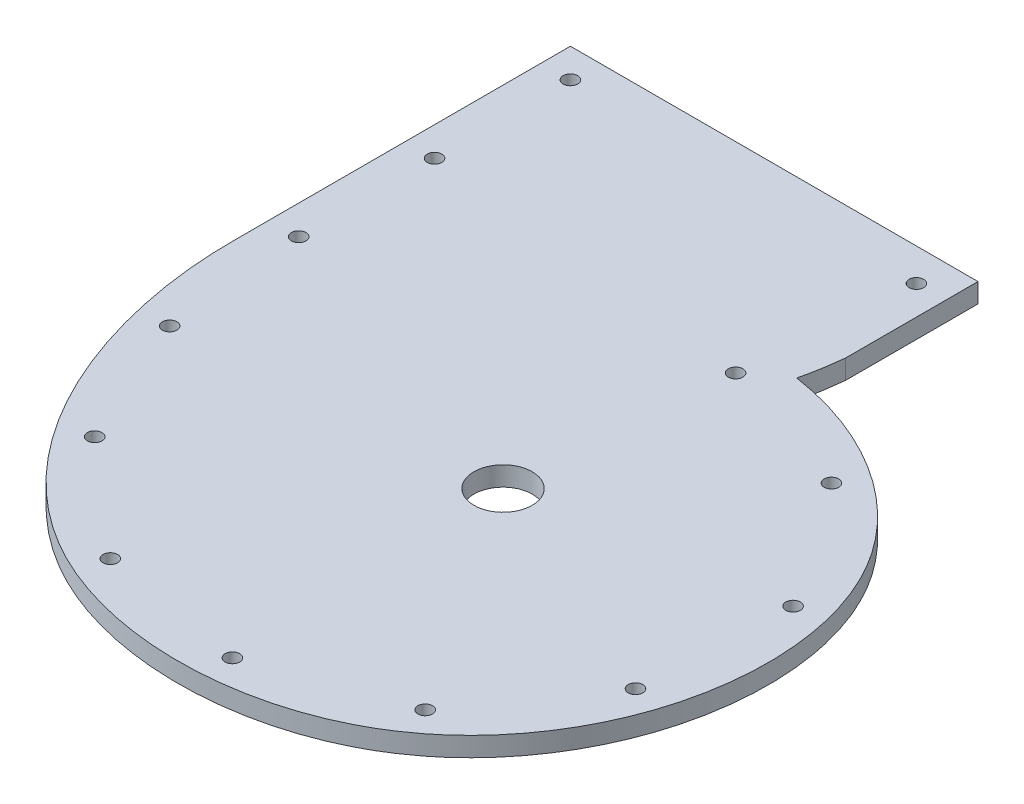
ISO-10303-21;
HEADER;
FILE_DESCRIPTION(('STEP AP214'),'2;1');
FILE_NAME('part.step','',(''),(''),'','','');
FILE_SCHEMA(('AUTOMOTIVE_DESIGN { 1 0 10303 214 1 1 1 1 }'));
ENDSEC;
DATA;
#1=APPLICATION_CONTEXT('core data for automotive mechanical design processes');
#2=APPLICATION_PROTOCOL_DEFINITION('international standard','automotive_design',2000,#1);
#3=PRODUCT_CONTEXT('',#1,'mechanical');
#4=PRODUCT('Part','Part','',(#3));
#5=PRODUCT_RELATED_PRODUCT_CATEGORY('part','',(#4));
#6=PRODUCT_DEFINITION_FORMATION('','',#4);
#7=PRODUCT_DEFINITION_CONTEXT('part definition',#1,'design');
#8=PRODUCT_DEFINITION('design','',#6,#7);
#9=PRODUCT_DEFINITION_SHAPE('','',#8);
#10=(LENGTH_UNIT() NAMED_UNIT(*) SI_UNIT(.MILLI.,.METRE.));
#11=(NAMED_UNIT(*) PLANE_ANGLE_UNIT() SI_UNIT($,.RADIAN.));
#12=(NAMED_UNIT(*) SI_UNIT($,.STERADIAN.) SOLID_ANGLE_UNIT());
#13=UNCERTAINTY_MEASURE_WITH_UNIT(LENGTH_MEASURE(1.E-05),#10,'distance_accuracy_value','');
#14=(GEOMETRIC_REPRESENTATION_CONTEXT(3) GLOBAL_UNCERTAINTY_ASSIGNED_CONTEXT((#13)) GLOBAL_UNIT_ASSIGNED_CONTEXT((#10,
#11,#12)) REPRESENTATION_CONTEXT('',''));
#15=CARTESIAN_POINT('',(0.,0.,0.));
#16=DIRECTION('',(0.,0.,1.));
#17=DIRECTION('',(1.,0.,0.));
#18=AXIS2_PLACEMENT_3D('',#15,#16,#17);
#19=CARTESIAN_POINT('',(19.05,6.35,-93.0525131214236));
#20=CARTESIAN_POINT('',(19.0235717626698,6.35,-92.8091366928728));
#21=CARTESIAN_POINT('',(18.9836928683942,6.35,-92.4430892244958));
#22=CARTESIAN_POINT('',(18.9314671624808,6.35,-91.9589572355302));
#23=CARTESIAN_POINT('',(18.8623607981838,6.35,-91.3379157509415));
#24=CARTESIAN_POINT('',(18.7762928711156,6.35,-90.6107808851603));
#25=CARTESIAN_POINT('',(18.6259027213404,6.35,-89.4251283904721));
#26=CARTESIAN_POINT('',(18.4201228683112,6.35,-87.9598584476399));
#27=CARTESIAN_POINT('',(18.0499905632596,6.35,-85.6275758075247));
#28=CARTESIAN_POINT('',(17.5101435713735,6.35,-82.7435971471794));
#29=CARTESIAN_POINT('',(16.996105498509,6.35,-80.4784646355363));
#30=CARTESIAN_POINT('',(16.7159863913014,6.35,-79.3485680085002));
#31=B_SPLINE_CURVE_WITH_KNOTS('',3,(#19,#20,#21,#22,#23,#24,#25,#26,#27,#28,#29,#30),
.UNSPECIFIED.,.F.,.F.,(4,1,1,1,1,1,1,1,1,4),(-0.0228949743215874,-0.00659054938911569,
0.00156166307712017,0.00971387554335602,0.0260183004758277,0.0423227254082994,
0.0749315752732429,0.107540425138186,0.172758124868073,0.23797582459796),.UNSPECIFIED.);
#32=DIRECTION('',(0.,-1.,0.));
#33=VECTOR('',#32,1.);
#34=SURFACE_OF_LINEAR_EXTRUSION('',#31,#33);
#35=CARTESIAN_POINT('',(19.05,0.,-93.0525131214236));
#36=CARTESIAN_POINT('',(19.0235717626698,0.,-92.8091366928728));
#37=CARTESIAN_POINT('',(18.9836928683942,0.,-92.4430892244958));
#38=CARTESIAN_POINT('',(18.9314671624808,0.,-91.9589572355302));
#39=CARTESIAN_POINT('',(18.8623607981838,0.,-91.3379157509415));
#40=CARTESIAN_POINT('',(18.7762928711156,0.,-90.6107808851603));
#41=CARTESIAN_POINT('',(18.6259027213404,0.,-89.4251283904721));
#42=CARTESIAN_POINT('',(18.4201228683112,0.,-87.9598584476399));
#43=CARTESIAN_POINT('',(18.0499905632596,0.,-85.6275758075247));
#44=CARTESIAN_POINT('',(17.5101435713735,0.,-82.7435971471794));
#45=CARTESIAN_POINT('',(16.996105498509,0.,-80.4784646355363));
#46=CARTESIAN_POINT('',(16.7159863913014,0.,-79.3485680085002));
#47=B_SPLINE_CURVE_WITH_KNOTS('',3,(#35,#36,#37,#38,#39,#40,#41,#42,#43,#44,#45,#46),
.UNSPECIFIED.,.F.,.F.,(4,1,1,1,1,1,1,1,1,4),(-0.0228949743215874,-0.00659054938911569,
0.00156166307712017,0.00971387554335602,0.0260183004758277,0.0423227254082994,
0.0749315752732429,0.107540425138186,0.172758124868073,0.23797582459796),.UNSPECIFIED.);
#48=CARTESIAN_POINT('',(19.05,0.,-93.0525131214236));
#49=VERTEX_POINT('',#48);
#50=CARTESIAN_POINT('',(16.7159863913014,0.,-79.3485680085002));
#51=VERTEX_POINT('',#50);
#52=EDGE_CURVE('E145',#49,#51,#47,.T.);
#53=ORIENTED_EDGE('',*,*,#52,.F.);
#54=DIRECTION('',(0.,-1.,0.));
#55=VECTOR('',#54,1.);
#56=CARTESIAN_POINT('',(19.05,6.35,-93.0525131214236));
#57=LINE('',#56,#55);
#58=CARTESIAN_POINT('',(19.05,6.35,-93.0525131214236));
#59=VERTEX_POINT('',#58);
#60=EDGE_CURVE('E13',#59,#49,#57,.T.);
#61=ORIENTED_EDGE('',*,*,#60,.F.);
#62=CARTESIAN_POINT('',(16.7159863913014,6.35,-79.3485680085002));
#63=VERTEX_POINT('',#62);
#64=EDGE_CURVE('E182',#59,#63,#31,.T.);
#65=ORIENTED_EDGE('',*,*,#64,.T.);
#66=DIRECTION('',(0.,-1.,0.));
#67=VECTOR('',#66,1.);
#68=CARTESIAN_POINT('',(16.7159863913014,6.35,-79.3485680085002));
#69=LINE('',#68,#67);
#70=EDGE_CURVE('E84',#63,#51,#69,.T.);
#71=ORIENTED_EDGE('',*,*,#70,.T.);
#72=EDGE_LOOP('',(#53,#61,#65,#71));
#73=FACE_BOUND('',#72,.T.);
#74=ADVANCED_FACE('F67',(#73),#34,.T.);
#75=CARTESIAN_POINT('',(19.05,6.35,0.));
#76=DIRECTION('',(1.,0.,0.));
#77=DIRECTION('',(0.,0.,-1.));
#78=AXIS2_PLACEMENT_3D('',#75,#76,#77);
#79=PLANE('',#78);
#80=DIRECTION('',(0.,0.,1.));
#81=VECTOR('',#80,1.);
#82=CARTESIAN_POINT('',(19.05,0.,0.));
#83=LINE('',#82,#81);
#84=CARTESIAN_POINT('',(19.05,0.,-136.334024978483));
#85=VERTEX_POINT('',#84);
#86=EDGE_CURVE('E170',#85,#49,#83,.T.);
#87=ORIENTED_EDGE('',*,*,#86,.F.);
#88=DIRECTION('',(0.,-1.,0.));
#89=VECTOR('',#88,1.);
#90=CARTESIAN_POINT('',(19.05,6.35,-136.334024978483));
#91=LINE('',#90,#89);
#92=CARTESIAN_POINT('',(19.05,6.35,-136.334024978483));
#93=VERTEX_POINT('',#92);
#94=EDGE_CURVE('E76',#93,#85,#91,.T.);
#95=ORIENTED_EDGE('',*,*,#94,.F.);
#96=DIRECTION('',(0.,0.,1.));
#97=VECTOR('',#96,1.);
#98=CARTESIAN_POINT('',(19.05,6.35,0.));
#99=LINE('',#98,#97);
#100=EDGE_CURVE('E125',#93,#59,#99,.T.);
#101=ORIENTED_EDGE('',*,*,#100,.T.);
#102=ORIENTED_EDGE('',*,*,#60,.T.);
#103=EDGE_LOOP('',(#87,#95,#101,#102));
#104=FACE_BOUND('',#103,.T.);
#105=ADVANCED_FACE('F162',(#104),#79,.T.);
#106=CARTESIAN_POINT('',(0.,6.35,-136.334024978483));
#107=DIRECTION('',(0.,0.,1.));
#108=DIRECTION('',(1.,0.,0.));
#109=AXIS2_PLACEMENT_3D('',#106,#107,#108);
#110=PLANE('',#109);
#111=DIRECTION('',(-1.,0.,0.));
#112=VECTOR('',#111,1.);
#113=CARTESIAN_POINT('',(0.,0.,-136.334024978483));
#114=LINE('',#113,#112);
#115=CARTESIAN_POINT('',(-114.3,0.,-136.334024978483));
#116=VERTEX_POINT('',#115);
#117=EDGE_CURVE('E132',#85,#116,#114,.T.);
#118=ORIENTED_EDGE('',*,*,#117,.T.);
#119=DIRECTION('',(0.,-1.,0.));
#120=VECTOR('',#119,1.);
#121=CARTESIAN_POINT('',(-114.3,6.35,-136.334024978483));
#122=LINE('',#121,#120);
#123=CARTESIAN_POINT('',(-114.3,6.35,-136.334024978483));
#124=VERTEX_POINT('',#123);
#125=EDGE_CURVE('E130',#124,#116,#122,.T.);
#126=ORIENTED_EDGE('',*,*,#125,.F.);
#127=DIRECTION('',(-1.,0.,0.));
#128=VECTOR('',#127,1.);
#129=CARTESIAN_POINT('',(0.,6.35,-136.334024978483));
#130=LINE('',#129,#128);
#131=EDGE_CURVE('E117',#93,#124,#130,.T.);
#132=ORIENTED_EDGE('',*,*,#131,.F.);
#133=ORIENTED_EDGE('',*,*,#94,.T.);
#134=EDGE_LOOP('',(#118,#126,#132,#133));
#135=FACE_BOUND('',#134,.T.);
#136=ADVANCED_FACE('F131',(#135),#110,.F.);
#137=CARTESIAN_POINT('',(-114.3,6.35,0.));
#138=DIRECTION('',(1.,0.,0.));
#139=DIRECTION('',(0.,0.,-1.));
#140=AXIS2_PLACEMENT_3D('',#137,#138,#139);
#141=PLANE('',#140);
#142=DIRECTION('',(0.,0.,1.));
#143=VECTOR('',#142,1.);
#144=CARTESIAN_POINT('',(-114.3,0.,0.));
#145=LINE('',#144,#143);
#146=CARTESIAN_POINT('',(-114.3,0.,-26.0721112281661));
#147=VERTEX_POINT('',#146);
#148=EDGE_CURVE('E172',#116,#147,#145,.T.);
#149=ORIENTED_EDGE('',*,*,#148,.T.);
#150=DIRECTION('',(0.,-1.,0.));
#151=VECTOR('',#150,1.);
#152=CARTESIAN_POINT('',(-114.3,6.35,-26.0721112281661));
#153=LINE('',#152,#151);
#154=CARTESIAN_POINT('',(-114.3,6.35,-26.0721112281661));
#155=VERTEX_POINT('',#154);
#156=EDGE_CURVE('E101',#155,#147,#153,.T.);
#157=ORIENTED_EDGE('',*,*,#156,.F.);
#158=DIRECTION('',(0.,0.,1.));
#159=VECTOR('',#158,1.);
#160=CARTESIAN_POINT('',(-114.3,6.35,0.));
#161=LINE('',#160,#159);
#162=EDGE_CURVE('E123',#124,#155,#161,.T.);
#163=ORIENTED_EDGE('',*,*,#162,.F.);
#164=ORIENTED_EDGE('',*,*,#125,.T.);
#165=EDGE_LOOP('',(#149,#157,#163,#164));
#166=FACE_BOUND('',#165,.T.);
#167=ADVANCED_FACE('F136',(#166),#141,.F.);
#168=CARTESIAN_POINT('',(16.7159863913014,6.35,-79.3485680085002));
#169=CARTESIAN_POINT('',(21.6330978705224,6.35,-78.6271989598531));
#170=CARTESIAN_POINT('',(31.3718572612699,6.35,-76.3897218941116));
#171=CARTESIAN_POINT('',(45.2492004972199,6.35,-70.8452769607163));
#172=CARTESIAN_POINT('',(58.1427020202069,6.35,-63.2023547019803));
#173=CARTESIAN_POINT('',(69.6942684990019,6.35,-53.48659400402));
#174=CARTESIAN_POINT('',(77.8316458808527,6.35,-43.6787438983676));
#175=CARTESIAN_POINT('',(83.1663553001762,6.35,-34.7783260421134));
#176=CARTESIAN_POINT('',(87.5006566564551,6.35,-25.5003387116442));
#177=CARTESIAN_POINT('',(91.1570644324476,6.35,-13.4000448880706));
#178=CARTESIAN_POINT('',(92.9989240789807,6.35,1.46366621805663));
#179=CARTESIAN_POINT('',(92.5331586276137,6.35,16.3321608555447));
#180=CARTESIAN_POINT('',(89.9113480457351,6.35,30.9228680078494));
#181=CARTESIAN_POINT('',(85.2246697026399,6.35,44.926534482478));
#182=CARTESIAN_POINT('',(78.5424766002794,6.35,58.0873215625547));
#183=CARTESIAN_POINT('',(69.8929665542091,6.35,70.1280882226925));
#184=CARTESIAN_POINT('',(59.3342250850972,6.35,80.7225189459671));
#185=CARTESIAN_POINT('',(46.8082946762808,6.35,89.4843789599546));
#186=CARTESIAN_POINT('',(33.1657508535722,6.35,95.8312045365591));
#187=CARTESIAN_POINT('',(18.8220757998214,6.35,100.000437450495));
#188=CARTESIAN_POINT('',(4.08382286145167,6.35,102.10160242432));
#189=CARTESIAN_POINT('',(-10.7774412230892,6.35,102.21979996101));
#190=CARTESIAN_POINT('',(-25.5048511364746,6.35,100.381408636179));
#191=CARTESIAN_POINT('',(-37.4527415030442,6.35,97.1973224935949));
#192=CARTESIAN_POINT('',(-46.6656390896169,6.35,93.6226539944936));
#193=CARTESIAN_POINT('',(-53.3782339827533,6.35,90.4042691275464));
#194=CARTESIAN_POINT('',(-59.7780191628772,6.35,86.6678318366041));
#195=CARTESIAN_POINT('',(-67.7729642470086,6.35,81.1134949695859));
#196=CARTESIAN_POINT('',(-76.7948383172267,6.35,73.1919966973664));
#197=CARTESIAN_POINT('',(-86.0825071986507,6.35,62.4802459776523));
#198=CARTESIAN_POINT('',(-96.5268651878926,6.35,46.9789350867326));
#199=CARTESIAN_POINT('',(-104.247410810002,6.35,30.1516401250863));
#200=CARTESIAN_POINT('',(-109.533831829891,6.35,12.8006946264713));
#201=CARTESIAN_POINT('',(-112.324631517154,6.35,-0.30605110665803));
#202=CARTESIAN_POINT('',(-113.69827349308,6.35,-11.1587802232802));
#203=CARTESIAN_POINT('',(-114.231429958165,6.35,-19.7408930873515));
#204=CARTESIAN_POINT('',(-114.308990647516,6.35,-23.9549561001606));
#205=CARTESIAN_POINT('',(-114.3,6.35,-26.0721112281661));
#206=B_SPLINE_CURVE_WITH_KNOTS('',3,(#168,#169,#170,#171,#172,#173,#174,#175,#176,#177,#178,
#179,#180,#181,#182,#183,#184,#185,#186,#187,#188,#189,#190,#191,#192,#193,#194,#195,#196,#197,
#198,#199,#200,#201,#202,#203,#204,#205),.UNSPECIFIED.,.F.,.F.,(4,1,1,1,1,1,1,1,1,1,1,1,1,1,1,1,
1,1,1,1,1,1,1,1,1,1,1,1,1,1,1,1,1,1,1,4),(0.0744180317666386,0.103339232907731,
0.132260434048823,0.161181635189916,0.190102836331008,0.2190240374721,0.233484638042646,
0.247945238613193,0.276866439754285,0.305787640895377,0.33470884203647,0.363630043177562,
0.392551244318654,0.421472445459747,0.450393646600839,0.479314847741931,0.508236048883024,
0.537157250024116,0.566078451165208,0.594999652306301,0.623920853447393,0.652842054588485,
0.681763255729578,0.696223856300124,0.71068445687067,0.725145057441216,0.739605658011762,
0.768526859152855,0.797448060293947,0.826369261435039,0.884211663717224,0.913132864858316,
0.942054065999409,0.970975267140501,0.985435867711047,0.999896468281593),.UNSPECIFIED.);
#207=DIRECTION('',(0.,-1.,0.));
#208=VECTOR('',#207,1.);
#209=SURFACE_OF_LINEAR_EXTRUSION('',#206,#208);
#210=CARTESIAN_POINT('',(16.7159863913014,0.,-79.3485680085002));
#211=CARTESIAN_POINT('',(21.6330978705224,0.,-78.6271989598531));
#212=CARTESIAN_POINT('',(31.3718572612699,0.,-76.3897218941116));
#213=CARTESIAN_POINT('',(45.2492004972199,0.,-70.8452769607163));
#214=CARTESIAN_POINT('',(58.1427020202069,0.,-63.2023547019803));
#215=CARTESIAN_POINT('',(69.6942684990019,0.,-53.48659400402));
#216=CARTESIAN_POINT('',(77.8316458808527,0.,-43.6787438983676));
#217=CARTESIAN_POINT('',(83.1663553001762,0.,-34.7783260421134));
#218=CARTESIAN_POINT('',(87.5006566564551,0.,-25.5003387116442));
#219=CARTESIAN_POINT('',(91.1570644324476,0.,-13.4000448880706));
#220=CARTESIAN_POINT('',(92.9989240789807,0.,1.46366621805663));
#221=CARTESIAN_POINT('',(92.5331586276137,0.,16.3321608555447));
#222=CARTESIAN_POINT('',(89.9113480457351,0.,30.9228680078494));
#223=CARTESIAN_POINT('',(85.2246697026399,0.,44.926534482478));
#224=CARTESIAN_POINT('',(78.5424766002794,0.,58.0873215625547));
#225=CARTESIAN_POINT('',(69.8929665542091,0.,70.1280882226925));
#226=CARTESIAN_POINT('',(59.3342250850972,0.,80.7225189459671));
#227=CARTESIAN_POINT('',(46.8082946762808,0.,89.4843789599546));
#228=CARTESIAN_POINT('',(33.1657508535722,0.,95.8312045365591));
#229=CARTESIAN_POINT('',(18.8220757998214,0.,100.000437450495));
#230=CARTESIAN_POINT('',(4.08382286145167,0.,102.10160242432));
#231=CARTESIAN_POINT('',(-10.7774412230892,0.,102.21979996101));
#232=CARTESIAN_POINT('',(-25.5048511364746,0.,100.381408636179));
#233=CARTESIAN_POINT('',(-37.4527415030442,0.,97.1973224935949));
#234=CARTESIAN_POINT('',(-46.6656390896169,0.,93.6226539944936));
#235=CARTESIAN_POINT('',(-53.3782339827533,0.,90.4042691275464));
#236=CARTESIAN_POINT('',(-59.7780191628772,0.,86.6678318366041));
#237=CARTESIAN_POINT('',(-67.7729642470086,0.,81.1134949695859));
#238=CARTESIAN_POINT('',(-76.7948383172267,0.,73.1919966973664));
#239=CARTESIAN_POINT('',(-86.0825071986507,0.,62.4802459776523));
#240=CARTESIAN_POINT('',(-96.5268651878926,0.,46.9789350867326));
#241=CARTESIAN_POINT('',(-104.247410810002,0.,30.1516401250863));
#242=CARTESIAN_POINT('',(-109.533831829891,0.,12.8006946264713));
#243=CARTESIAN_POINT('',(-112.324631517154,0.,-0.30605110665803));
#244=CARTESIAN_POINT('',(-113.69827349308,0.,-11.1587802232802));
#245=CARTESIAN_POINT('',(-114.231429958165,0.,-19.7408930873515));
#246=CARTESIAN_POINT('',(-114.308990647516,0.,-23.9549561001606));
#247=CARTESIAN_POINT('',(-114.3,0.,-26.0721112281661));
#248=B_SPLINE_CURVE_WITH_KNOTS('',3,(#210,#211,#212,#213,#214,#215,#216,#217,#218,#219,#220,
#221,#222,#223,#224,#225,#226,#227,#228,#229,#230,#231,#232,#233,#234,#235,#236,#237,#238,#239,
#240,#241,#242,#243,#244,#245,#246,#247),.UNSPECIFIED.,.F.,.F.,(4,1,1,1,1,1,1,1,1,1,1,1,1,1,1,1,
1,1,1,1,1,1,1,1,1,1,1,1,1,1,1,1,1,1,1,4),(0.0744180317666386,0.103339232907731,
0.132260434048823,0.161181635189916,0.190102836331008,0.2190240374721,0.233484638042646,
0.247945238613193,0.276866439754285,0.305787640895377,0.33470884203647,0.363630043177562,
0.392551244318654,0.421472445459747,0.450393646600839,0.479314847741931,0.508236048883024,
0.537157250024116,0.566078451165208,0.594999652306301,0.623920853447393,0.652842054588485,
0.681763255729578,0.696223856300124,0.71068445687067,0.725145057441216,0.739605658011762,
0.768526859152855,0.797448060293947,0.826369261435039,0.884211663717224,0.913132864858316,
0.942054065999409,0.970975267140501,0.985435867711047,0.999896468281593),.UNSPECIFIED.);
#249=EDGE_CURVE('E177',#51,#147,#248,.T.);
#250=ORIENTED_EDGE('',*,*,#249,.F.);
#251=ORIENTED_EDGE('',*,*,#70,.F.);
#252=EDGE_CURVE('E137',#63,#155,#206,.T.);
#253=ORIENTED_EDGE('',*,*,#252,.T.);
#254=ORIENTED_EDGE('',*,*,#156,.T.);
#255=EDGE_LOOP('',(#250,#251,#253,#254));
#256=FACE_BOUND('',#255,.T.);
#257=ADVANCED_FACE('F153',(#256),#209,.T.);
#258=CARTESIAN_POINT('',(0.,6.35,0.));
#259=DIRECTION('',(0.,1.,0.));
#260=DIRECTION('',(0.,0.,1.));
#261=AXIS2_PLACEMENT_3D('',#258,#259,#260);
#262=PLANE('',#261);
#263=CARTESIAN_POINT('',(9.52499999999998,6.34999999986404,-125.703541590997));
#264=DIRECTION('',(0.,1.,0.));
#265=DIRECTION('',(0.,0.,1.));
#266=AXIS2_PLACEMENT_3D('',#263,#264,#265);
#267=CIRCLE('',#266,2.38125);
#268=CARTESIAN_POINT('',(9.52499999999998,6.34999999986404,-123.322291590997));
#269=VERTEX_POINT('',#268);
#270=EDGE_CURVE('E266',#269,#269,#267,.T.);
#271=ORIENTED_EDGE('',*,*,#270,.F.);
#272=EDGE_LOOP('',(#271));
#273=FACE_BOUND('',#272,.T.);
#274=CARTESIAN_POINT('',(5.30214698446013,6.34999999987513,-70.7696736998972));
#275=DIRECTION('',(0.,1.,0.));
#276=DIRECTION('',(0.,0.,1.));
#277=AXIS2_PLACEMENT_3D('',#274,#275,#276);
#278=CIRCLE('',#277,2.38125);
#279=CARTESIAN_POINT('',(5.30214698446013,6.34999999987513,-68.3884236998972));
#280=VERTEX_POINT('',#279);
#281=EDGE_CURVE('E260',#280,#280,#278,.T.);
#282=ORIENTED_EDGE('',*,*,#281,.F.);
#283=EDGE_LOOP('',(#282));
#284=FACE_BOUND('',#283,.T.);
#285=CARTESIAN_POINT('',(52.1827380609273,6.34999999986884,-55.2474860426569));
#286=DIRECTION('',(0.,1.,0.));
#287=DIRECTION('',(0.,0.,1.));
#288=AXIS2_PLACEMENT_3D('',#285,#286,#287);
#289=CIRCLE('',#288,2.38125);
#290=CARTESIAN_POINT('',(52.1827380609273,6.34999999986884,-52.8662360426569));
#291=VERTEX_POINT('',#290);
#292=EDGE_CURVE('E254',#291,#291,#289,.T.);
#293=ORIENTED_EDGE('',*,*,#292,.F.);
#294=EDGE_LOOP('',(#293));
#295=FACE_BOUND('',#294,.T.);
#296=CARTESIAN_POINT('',(80.7824142416887,6.34999999986437,-14.1065356394769));
#297=DIRECTION('',(0.,1.,0.));
#298=DIRECTION('',(0.,0.,1.));
#299=AXIS2_PLACEMENT_3D('',#296,#297,#298);
#300=CIRCLE('',#299,2.38125);
#301=CARTESIAN_POINT('',(80.7824142416887,6.34999999986437,-11.7252856394769));
#302=VERTEX_POINT('',#301);
#303=EDGE_CURVE('E248',#302,#302,#300,.T.);
#304=ORIENTED_EDGE('',*,*,#303,.F.);
#305=EDGE_LOOP('',(#304));
#306=FACE_BOUND('',#305,.T.);
#307=CARTESIAN_POINT('',(78.3880407363537,6.34999999986463,35.05863295914));
#308=DIRECTION('',(0.,1.,0.));
#309=DIRECTION('',(0.,0.,1.));
#310=AXIS2_PLACEMENT_3D('',#307,#308,#309);
#311=CIRCLE('',#310,2.38125);
#312=CARTESIAN_POINT('',(78.3880407363537,6.34999999986463,37.43988295914));
#313=VERTEX_POINT('',#312);
#314=EDGE_CURVE('E242',#313,#313,#311,.T.);
#315=ORIENTED_EDGE('',*,*,#314,.F.);
#316=EDGE_LOOP('',(#315));
#317=FACE_BOUND('',#316,.T.);
#318=CARTESIAN_POINT('',(49.9706498896961,6.34999999986851,75.4506365341561));
#319=DIRECTION('',(0.,1.,0.));
#320=DIRECTION('',(0.,0.,1.));
#321=AXIS2_PLACEMENT_3D('',#318,#319,#320);
#322=CIRCLE('',#321,2.38125);
#323=CARTESIAN_POINT('',(49.9706498896961,6.34999999986851,77.8318865341562));
#324=VERTEX_POINT('',#323);
#325=EDGE_CURVE('E236',#324,#324,#322,.T.);
#326=ORIENTED_EDGE('',*,*,#325,.F.);
#327=EDGE_LOOP('',(#326));
#328=FACE_BOUND('',#327,.T.);
#329=CARTESIAN_POINT('',(3.69898710459614,6.34999999987448,92.2460743206198));
#330=DIRECTION('',(0.,1.,0.));
#331=DIRECTION('',(0.,0.,1.));
#332=AXIS2_PLACEMENT_3D('',#329,#330,#331);
#333=CIRCLE('',#332,2.38125);
#334=CARTESIAN_POINT('',(3.69898710459614,6.34999999987448,94.6273243206198));
#335=VERTEX_POINT('',#334);
#336=EDGE_CURVE('E230',#335,#335,#333,.T.);
#337=ORIENTED_EDGE('',*,*,#336,.F.);
#338=EDGE_LOOP('',(#337));
#339=FACE_BOUND('',#338,.T.);
#340=CARTESIAN_POINT('',(-44.376132313222,6.34999999988007,84.1129830272196));
#341=DIRECTION('',(0.,1.,0.));
#342=DIRECTION('',(0.,0.,1.));
#343=AXIS2_PLACEMENT_3D('',#340,#341,#342);
#344=CIRCLE('',#343,2.38125);
#345=CARTESIAN_POINT('',(-44.376132313222,6.34999999988007,86.4942330272196));
#346=VERTEX_POINT('',#345);
#347=EDGE_CURVE('E224',#346,#346,#344,.T.);
#348=ORIENTED_EDGE('',*,*,#347,.F.);
#349=EDGE_LOOP('',(#348));
#350=FACE_BOUND('',#349,.T.);
#351=CARTESIAN_POINT('',(-81.4745539995221,6.34999999988469,52.1414717650409));
#352=DIRECTION('',(0.,1.,0.));
#353=DIRECTION('',(0.,0.,1.));
#354=AXIS2_PLACEMENT_3D('',#351,#352,#353);
#355=CIRCLE('',#354,2.38125);
#356=CARTESIAN_POINT('',(-81.4745539995221,6.34999999988469,54.5227217650409));
#357=VERTEX_POINT('',#356);
#358=EDGE_CURVE('E218',#357,#357,#355,.T.);
#359=ORIENTED_EDGE('',*,*,#358,.F.);
#360=EDGE_LOOP('',(#359));
#361=FACE_BOUND('',#360,.T.);
#362=CARTESIAN_POINT('',(-100.597903534507,6.34999999988637,8.4863561783266));
#363=DIRECTION('',(0.,1.,0.));
#364=DIRECTION('',(0.,0.,1.));
#365=AXIS2_PLACEMENT_3D('',#362,#363,#364);
#366=CIRCLE('',#365,2.38125);
#367=CARTESIAN_POINT('',(-100.597903534507,6.34999999988637,10.8676061783266));
#368=VERTEX_POINT('',#367);
#369=EDGE_CURVE('E212',#368,#368,#366,.T.);
#370=ORIENTED_EDGE('',*,*,#369,.F.);
#371=EDGE_LOOP('',(#370));
#372=FACE_BOUND('',#371,.T.);
#373=CARTESIAN_POINT('',(-104.775,6.3499999998867,-37.9090249784825));
#374=DIRECTION('',(0.,1.,0.));
#375=DIRECTION('',(0.,0.,1.));
#376=AXIS2_PLACEMENT_3D('',#373,#374,#375);
#377=CIRCLE('',#376,2.38125);
#378=CARTESIAN_POINT('',(-104.775,6.3499999998867,-35.5277749784825));
#379=VERTEX_POINT('',#378);
#380=EDGE_CURVE('E206',#379,#379,#377,.T.);
#381=ORIENTED_EDGE('',*,*,#380,.F.);
#382=EDGE_LOOP('',(#381));
#383=FACE_BOUND('',#382,.T.);
#384=CARTESIAN_POINT('',(-104.775,6.3499999998867,-82.3590249784825));
#385=DIRECTION('',(0.,1.,0.));
#386=DIRECTION('',(0.,0.,1.));
#387=AXIS2_PLACEMENT_3D('',#384,#385,#386);
#388=CIRCLE('',#387,2.38125);
#389=CARTESIAN_POINT('',(-104.775,6.3499999998867,-79.9777749784825));
#390=VERTEX_POINT('',#389);
#391=EDGE_CURVE('E200',#390,#390,#388,.T.);
#392=ORIENTED_EDGE('',*,*,#391,.F.);
#393=EDGE_LOOP('',(#392));
#394=FACE_BOUND('',#393,.T.);
#395=CARTESIAN_POINT('',(-104.775,6.35,-126.809024978483));
#396=DIRECTION('',(0.,1.,0.));
#397=DIRECTION('',(0.,0.,1.));
#398=AXIS2_PLACEMENT_3D('',#395,#396,#397);
#399=CIRCLE('',#398,2.38125);
#400=CARTESIAN_POINT('',(-104.775,6.35,-124.427774978483));
#401=VERTEX_POINT('',#400);
#402=EDGE_CURVE('E191',#401,#401,#399,.T.);
#403=ORIENTED_EDGE('',*,*,#402,.F.);
#404=EDGE_LOOP('',(#403));
#405=FACE_BOUND('',#404,.T.);
#406=ORIENTED_EDGE('',*,*,#131,.T.);
#407=ORIENTED_EDGE('',*,*,#162,.T.);
#408=ORIENTED_EDGE('',*,*,#252,.F.);
#409=ORIENTED_EDGE('',*,*,#64,.F.);
#410=ORIENTED_EDGE('',*,*,#100,.F.);
#411=EDGE_LOOP('',(#406,#407,#408,#409,#410));
#412=FACE_BOUND('',#411,.T.);
#413=CARTESIAN_POINT('',(0.,6.35,0.));
#414=DIRECTION('',(0.,1.,0.));
#415=DIRECTION('',(0.,0.,1.));
#416=AXIS2_PLACEMENT_3D('',#413,#414,#415);
#417=CIRCLE('',#416,9.525);
#418=CARTESIAN_POINT('',(0.,6.35,9.525));
#419=VERTEX_POINT('',#418);
#420=EDGE_CURVE('E272',#419,#419,#417,.T.);
#421=ORIENTED_EDGE('',*,*,#420,.F.);
#422=EDGE_LOOP('',(#421));
#423=FACE_BOUND('',#422,.T.);
#424=ADVANCED_FACE('F119',(#273,#284,#295,#306,#317,#328,#339,#350,#361,#372,#383,#394,#405,
#412,#423),#262,.T.);
#425=CARTESIAN_POINT('',(0.,0.,0.));
#426=DIRECTION('',(0.,1.,0.));
#427=DIRECTION('',(0.,0.,1.));
#428=AXIS2_PLACEMENT_3D('',#425,#426,#427);
#429=PLANE('',#428);
#430=ORIENTED_EDGE('',*,*,#117,.F.);
#431=ORIENTED_EDGE('',*,*,#86,.T.);
#432=ORIENTED_EDGE('',*,*,#52,.T.);
#433=ORIENTED_EDGE('',*,*,#249,.T.);
#434=ORIENTED_EDGE('',*,*,#148,.F.);
#435=EDGE_LOOP('',(#430,#431,#432,#433,#434));
#436=FACE_BOUND('',#435,.T.);
#437=CARTESIAN_POINT('',(9.52499999999998,-1.3596415660011E-10,-125.703541590997));
#438=DIRECTION('',(0.,1.,0.));
#439=DIRECTION('',(0.,0.,1.));
#440=AXIS2_PLACEMENT_3D('',#437,#438,#439);
#441=CIRCLE('',#440,2.38125);
#442=CARTESIAN_POINT('',(9.52499999999998,-1.3596415660011E-10,-123.322291590997));
#443=VERTEX_POINT('',#442);
#444=EDGE_CURVE('E263',#443,#443,#441,.T.);
#445=ORIENTED_EDGE('',*,*,#444,.T.);
#446=EDGE_LOOP('',(#445));
#447=FACE_BOUND('',#446,.T.);
#448=CARTESIAN_POINT('',(5.30214698446013,-1.2487406941819E-10,-70.7696736998972));
#449=DIRECTION('',(0.,1.,0.));
#450=DIRECTION('',(0.,0.,1.));
#451=AXIS2_PLACEMENT_3D('',#448,#449,#450);
#452=CIRCLE('',#451,2.38125);
#453=CARTESIAN_POINT('',(5.30214698446013,-1.2487406941819E-10,-68.3884236998972));
#454=VERTEX_POINT('',#453);
#455=EDGE_CURVE('E257',#454,#454,#452,.T.);
#456=ORIENTED_EDGE('',*,*,#455,.T.);
#457=EDGE_LOOP('',(#456));
#458=FACE_BOUND('',#457,.T.);
#459=CARTESIAN_POINT('',(52.1827380609273,-1.31162442018606E-10,-55.2474860426569));
#460=DIRECTION('',(0.,1.,0.));
#461=DIRECTION('',(0.,0.,1.));
#462=AXIS2_PLACEMENT_3D('',#459,#460,#461);
#463=CIRCLE('',#462,2.38125);
#464=CARTESIAN_POINT('',(52.1827380609273,-1.31162442018606E-10,-52.8662360426569));
#465=VERTEX_POINT('',#464);
#466=EDGE_CURVE('E251',#465,#465,#463,.T.);
#467=ORIENTED_EDGE('',*,*,#466,.T.);
#468=EDGE_LOOP('',(#467));
#469=FACE_BOUND('',#468,.T.);
#470=CARTESIAN_POINT('',(80.7824142416887,-1.35625885522295E-10,-14.1065356394769));
#471=DIRECTION('',(0.,1.,0.));
#472=DIRECTION('',(0.,0.,1.));
#473=AXIS2_PLACEMENT_3D('',#470,#471,#472);
#474=CIRCLE('',#473,2.38125);
#475=CARTESIAN_POINT('',(80.7824142416887,-1.35625885522295E-10,-11.7252856394769));
#476=VERTEX_POINT('',#475);
#477=EDGE_CURVE('E245',#476,#476,#474,.T.);
#478=ORIENTED_EDGE('',*,*,#477,.T.);
#479=EDGE_LOOP('',(#478));
#480=FACE_BOUND('',#479,.T.);
#481=CARTESIAN_POINT('',(78.3880407363537,-1.3536914644785E-10,35.05863295914));
#482=DIRECTION('',(0.,1.,0.));
#483=DIRECTION('',(0.,0.,1.));
#484=AXIS2_PLACEMENT_3D('',#481,#482,#483);
#485=CIRCLE('',#484,2.38125);
#486=CARTESIAN_POINT('',(78.3880407363537,-1.3536914644785E-10,37.43988295914));
#487=VERTEX_POINT('',#486);
#488=EDGE_CURVE('E239',#487,#487,#485,.T.);
#489=ORIENTED_EDGE('',*,*,#488,.T.);
#490=EDGE_LOOP('',(#489));
#491=FACE_BOUND('',#490,.T.);
#492=CARTESIAN_POINT('',(49.9706498896961,-1.3149290684078E-10,75.4506365341561));
#493=DIRECTION('',(0.,1.,0.));
#494=DIRECTION('',(0.,0.,1.));
#495=AXIS2_PLACEMENT_3D('',#492,#493,#494);
#496=CIRCLE('',#495,2.38125);
#497=CARTESIAN_POINT('',(49.9706498896961,-1.3149290684078E-10,77.8318865341562));
#498=VERTEX_POINT('',#497);
#499=EDGE_CURVE('E233',#498,#498,#496,.T.);
#500=ORIENTED_EDGE('',*,*,#499,.T.);
#501=EDGE_LOOP('',(#500));
#502=FACE_BOUND('',#501,.T.);
#503=CARTESIAN_POINT('',(3.69898710459614,-1.25520253912992E-10,92.2460743206198));
#504=DIRECTION('',(0.,1.,0.));
#505=DIRECTION('',(0.,0.,1.));
#506=AXIS2_PLACEMENT_3D('',#503,#504,#505);
#507=CIRCLE('',#506,2.38125);
#508=CARTESIAN_POINT('',(3.69898710459614,-1.25520253912992E-10,94.6273243206198));
#509=VERTEX_POINT('',#508);
#510=EDGE_CURVE('E227',#509,#509,#507,.T.);
#511=ORIENTED_EDGE('',*,*,#510,.T.);
#512=EDGE_LOOP('',(#511));
#513=FACE_BOUND('',#512,.T.);
#514=CARTESIAN_POINT('',(-44.376132313222,-1.19930974873395E-10,84.1129830272196));
#515=DIRECTION('',(0.,1.,0.));
#516=DIRECTION('',(0.,0.,1.));
#517=AXIS2_PLACEMENT_3D('',#514,#515,#516);
#518=CIRCLE('',#517,2.38125);
#519=CARTESIAN_POINT('',(-44.376132313222,-1.19930974873395E-10,86.4942330272196));
#520=VERTEX_POINT('',#519);
#521=EDGE_CURVE('E221',#520,#520,#518,.T.);
#522=ORIENTED_EDGE('',*,*,#521,.T.);
#523=EDGE_LOOP('',(#522));
#524=FACE_BOUND('',#523,.T.);
#525=CARTESIAN_POINT('',(-81.4745539995221,-1.15307936809916E-10,52.1414717650409));
#526=DIRECTION('',(0.,1.,0.));
#527=DIRECTION('',(0.,0.,1.));
#528=AXIS2_PLACEMENT_3D('',#525,#526,#527);
#529=CIRCLE('',#528,2.38125);
#530=CARTESIAN_POINT('',(-81.4745539995221,-1.15307936809916E-10,54.5227217650409));
#531=VERTEX_POINT('',#530);
#532=EDGE_CURVE('E215',#531,#531,#529,.T.);
#533=ORIENTED_EDGE('',*,*,#532,.T.);
#534=EDGE_LOOP('',(#533));
#535=FACE_BOUND('',#534,.T.);
#536=CARTESIAN_POINT('',(-100.597903534507,-1.13626989761695E-10,8.4863561783266));
#537=DIRECTION('',(0.,1.,0.));
#538=DIRECTION('',(0.,0.,1.));
#539=AXIS2_PLACEMENT_3D('',#536,#537,#538);
#540=CIRCLE('',#539,2.38125);
#541=CARTESIAN_POINT('',(-100.597903534507,-1.13626989761695E-10,10.8676061783266));
#542=VERTEX_POINT('',#541);
#543=EDGE_CURVE('E209',#542,#542,#540,.T.);
#544=ORIENTED_EDGE('',*,*,#543,.T.);
#545=EDGE_LOOP('',(#544));
#546=FACE_BOUND('',#545,.T.);
#547=CARTESIAN_POINT('',(-104.775,-1.13303463833425E-10,-37.9090249784825));
#548=DIRECTION('',(0.,1.,0.));
#549=DIRECTION('',(0.,0.,1.));
#550=AXIS2_PLACEMENT_3D('',#547,#548,#549);
#551=CIRCLE('',#550,2.38125);
#552=CARTESIAN_POINT('',(-104.775,-1.13303463833425E-10,-35.5277749784825));
#553=VERTEX_POINT('',#552);
#554=EDGE_CURVE('E203',#553,#553,#551,.T.);
#555=ORIENTED_EDGE('',*,*,#554,.T.);
#556=EDGE_LOOP('',(#555));
#557=FACE_BOUND('',#556,.T.);
#558=CARTESIAN_POINT('',(-104.775,-1.13303463833425E-10,-82.3590249784825));
#559=DIRECTION('',(0.,1.,0.));
#560=DIRECTION('',(0.,0.,1.));
#561=AXIS2_PLACEMENT_3D('',#558,#559,#560);
#562=CIRCLE('',#561,2.38125);
#563=CARTESIAN_POINT('',(-104.775,-1.13303463833425E-10,-79.9777749784825));
#564=VERTEX_POINT('',#563);
#565=EDGE_CURVE('E197',#564,#564,#562,.T.);
#566=ORIENTED_EDGE('',*,*,#565,.T.);
#567=EDGE_LOOP('',(#566));
#568=FACE_BOUND('',#567,.T.);
#569=CARTESIAN_POINT('',(-104.775,0.,-126.809024978483));
#570=DIRECTION('',(0.,1.,0.));
#571=DIRECTION('',(0.,0.,1.));
#572=AXIS2_PLACEMENT_3D('',#569,#570,#571);
#573=CIRCLE('',#572,2.38125);
#574=CARTESIAN_POINT('',(-104.775,0.,-124.427774978483));
#575=VERTEX_POINT('',#574);
#576=EDGE_CURVE('E174',#575,#575,#573,.T.);
#577=ORIENTED_EDGE('',*,*,#576,.T.);
#578=EDGE_LOOP('',(#577));
#579=FACE_BOUND('',#578,.T.);
#580=CARTESIAN_POINT('',(0.,0.,0.));
#581=DIRECTION('',(0.,1.,0.));
#582=DIRECTION('',(0.,0.,1.));
#583=AXIS2_PLACEMENT_3D('',#580,#581,#582);
#584=CIRCLE('',#583,9.525);
#585=CARTESIAN_POINT('',(0.,0.,9.525));
#586=VERTEX_POINT('',#585);
#587=EDGE_CURVE('E269',#586,#586,#584,.T.);
#588=ORIENTED_EDGE('',*,*,#587,.T.);
#589=EDGE_LOOP('',(#588));
#590=FACE_BOUND('',#589,.T.);
#591=ADVANCED_FACE('F157',(#436,#447,#458,#469,#480,#491,#502,#513,#524,#535,#546,#557,#568,
#579,#590),#429,.F.);
#592=CARTESIAN_POINT('',(-104.775,0.,-126.809024978483));
#593=DIRECTION('',(0.,1.,0.));
#594=DIRECTION('',(0.,0.,1.));
#595=AXIS2_PLACEMENT_3D('',#592,#593,#594);
#596=CYLINDRICAL_SURFACE('',#595,2.38125);
#597=ORIENTED_EDGE('',*,*,#576,.F.);
#598=EDGE_LOOP('',(#597));
#599=FACE_BOUND('',#598,.T.);
#600=ORIENTED_EDGE('',*,*,#402,.T.);
#601=EDGE_LOOP('',(#600));
#602=FACE_BOUND('',#601,.T.);
#603=ADVANCED_FACE('F290',(#599,#602),#596,.F.);
#604=CARTESIAN_POINT('',(-104.775,-1.13303463833425E-10,-82.3590249784825));
#605=DIRECTION('',(0.,1.,0.));
#606=DIRECTION('',(0.,0.,1.));
#607=AXIS2_PLACEMENT_3D('',#604,#605,#606);
#608=CYLINDRICAL_SURFACE('',#607,2.38125);
#609=ORIENTED_EDGE('',*,*,#565,.F.);
#610=EDGE_LOOP('',(#609));
#611=FACE_BOUND('',#610,.T.);
#612=ORIENTED_EDGE('',*,*,#391,.T.);
#613=EDGE_LOOP('',(#612));
#614=FACE_BOUND('',#613,.T.);
#615=ADVANCED_FACE('F296',(#611,#614),#608,.F.);
#616=CARTESIAN_POINT('',(-104.775,-1.13303463833425E-10,-37.9090249784825));
#617=DIRECTION('',(0.,1.,0.));
#618=DIRECTION('',(0.,0.,1.));
#619=AXIS2_PLACEMENT_3D('',#616,#617,#618);
#620=CYLINDRICAL_SURFACE('',#619,2.38125);
#621=ORIENTED_EDGE('',*,*,#554,.F.);
#622=EDGE_LOOP('',(#621));
#623=FACE_BOUND('',#622,.T.);
#624=ORIENTED_EDGE('',*,*,#380,.T.);
#625=EDGE_LOOP('',(#624));
#626=FACE_BOUND('',#625,.T.);
#627=ADVANCED_FACE('F300',(#623,#626),#620,.F.);
#628=CARTESIAN_POINT('',(-100.597903534507,-1.13626989761695E-10,8.4863561783266));
#629=DIRECTION('',(0.,1.,0.));
#630=DIRECTION('',(0.,0.,1.));
#631=AXIS2_PLACEMENT_3D('',#628,#629,#630);
#632=CYLINDRICAL_SURFACE('',#631,2.38125);
#633=ORIENTED_EDGE('',*,*,#543,.F.);
#634=EDGE_LOOP('',(#633));
#635=FACE_BOUND('',#634,.T.);
#636=ORIENTED_EDGE('',*,*,#369,.T.);
#637=EDGE_LOOP('',(#636));
#638=FACE_BOUND('',#637,.T.);
#639=ADVANCED_FACE('F304',(#635,#638),#632,.F.);
#640=CARTESIAN_POINT('',(-81.4745539995221,-1.15307936809916E-10,52.1414717650409));
#641=DIRECTION('',(0.,1.,0.));
#642=DIRECTION('',(0.,0.,1.));
#643=AXIS2_PLACEMENT_3D('',#640,#641,#642);
#644=CYLINDRICAL_SURFACE('',#643,2.38125);
#645=ORIENTED_EDGE('',*,*,#532,.F.);
#646=EDGE_LOOP('',(#645));
#647=FACE_BOUND('',#646,.T.);
#648=ORIENTED_EDGE('',*,*,#358,.T.);
#649=EDGE_LOOP('',(#648));
#650=FACE_BOUND('',#649,.T.);
#651=ADVANCED_FACE('F308',(#647,#650),#644,.F.);
#652=CARTESIAN_POINT('',(-44.376132313222,-1.19930974873395E-10,84.1129830272196));
#653=DIRECTION('',(0.,1.,0.));
#654=DIRECTION('',(0.,0.,1.));
#655=AXIS2_PLACEMENT_3D('',#652,#653,#654);
#656=CYLINDRICAL_SURFACE('',#655,2.38125);
#657=ORIENTED_EDGE('',*,*,#521,.F.);
#658=EDGE_LOOP('',(#657));
#659=FACE_BOUND('',#658,.T.);
#660=ORIENTED_EDGE('',*,*,#347,.T.);
#661=EDGE_LOOP('',(#660));
#662=FACE_BOUND('',#661,.T.);
#663=ADVANCED_FACE('F312',(#659,#662),#656,.F.);
#664=CARTESIAN_POINT('',(3.69898710459614,-1.25520253912992E-10,92.2460743206198));
#665=DIRECTION('',(0.,1.,0.));
#666=DIRECTION('',(0.,0.,1.));
#667=AXIS2_PLACEMENT_3D('',#664,#665,#666);
#668=CYLINDRICAL_SURFACE('',#667,2.38125);
#669=ORIENTED_EDGE('',*,*,#510,.F.);
#670=EDGE_LOOP('',(#669));
#671=FACE_BOUND('',#670,.T.);
#672=ORIENTED_EDGE('',*,*,#336,.T.);
#673=EDGE_LOOP('',(#672));
#674=FACE_BOUND('',#673,.T.);
#675=ADVANCED_FACE('F316',(#671,#674),#668,.F.);
#676=CARTESIAN_POINT('',(49.9706498896961,-1.3149290684078E-10,75.4506365341561));
#677=DIRECTION('',(0.,1.,0.));
#678=DIRECTION('',(0.,0.,1.));
#679=AXIS2_PLACEMENT_3D('',#676,#677,#678);
#680=CYLINDRICAL_SURFACE('',#679,2.38125);
#681=ORIENTED_EDGE('',*,*,#499,.F.);
#682=EDGE_LOOP('',(#681));
#683=FACE_BOUND('',#682,.T.);
#684=ORIENTED_EDGE('',*,*,#325,.T.);
#685=EDGE_LOOP('',(#684));
#686=FACE_BOUND('',#685,.T.);
#687=ADVANCED_FACE('F320',(#683,#686),#680,.F.);
#688=CARTESIAN_POINT('',(78.3880407363537,-1.3536914644785E-10,35.05863295914));
#689=DIRECTION('',(0.,1.,0.));
#690=DIRECTION('',(0.,0.,1.));
#691=AXIS2_PLACEMENT_3D('',#688,#689,#690);
#692=CYLINDRICAL_SURFACE('',#691,2.38125);
#693=ORIENTED_EDGE('',*,*,#488,.F.);
#694=EDGE_LOOP('',(#693));
#695=FACE_BOUND('',#694,.T.);
#696=ORIENTED_EDGE('',*,*,#314,.T.);
#697=EDGE_LOOP('',(#696));
#698=FACE_BOUND('',#697,.T.);
#699=ADVANCED_FACE('F324',(#695,#698),#692,.F.);
#700=CARTESIAN_POINT('',(80.7824142416887,-1.35625885522295E-10,-14.1065356394769));
#701=DIRECTION('',(0.,1.,0.));
#702=DIRECTION('',(0.,0.,1.));
#703=AXIS2_PLACEMENT_3D('',#700,#701,#702);
#704=CYLINDRICAL_SURFACE('',#703,2.38125);
#705=ORIENTED_EDGE('',*,*,#477,.F.);
#706=EDGE_LOOP('',(#705));
#707=FACE_BOUND('',#706,.T.);
#708=ORIENTED_EDGE('',*,*,#303,.T.);
#709=EDGE_LOOP('',(#708));
#710=FACE_BOUND('',#709,.T.);
#711=ADVANCED_FACE('F328',(#707,#710),#704,.F.);
#712=CARTESIAN_POINT('',(52.1827380609273,-1.31162442018606E-10,-55.2474860426569));
#713=DIRECTION('',(0.,1.,0.));
#714=DIRECTION('',(0.,0.,1.));
#715=AXIS2_PLACEMENT_3D('',#712,#713,#714);
#716=CYLINDRICAL_SURFACE('',#715,2.38125);
#717=ORIENTED_EDGE('',*,*,#466,.F.);
#718=EDGE_LOOP('',(#717));
#719=FACE_BOUND('',#718,.T.);
#720=ORIENTED_EDGE('',*,*,#292,.T.);
#721=EDGE_LOOP('',(#720));
#722=FACE_BOUND('',#721,.T.);
#723=ADVANCED_FACE('F332',(#719,#722),#716,.F.);
#724=CARTESIAN_POINT('',(5.30214698446013,-1.2487406941819E-10,-70.7696736998972));
#725=DIRECTION('',(0.,1.,0.));
#726=DIRECTION('',(0.,0.,1.));
#727=AXIS2_PLACEMENT_3D('',#724,#725,#726);
#728=CYLINDRICAL_SURFACE('',#727,2.38125);
#729=ORIENTED_EDGE('',*,*,#455,.F.);
#730=EDGE_LOOP('',(#729));
#731=FACE_BOUND('',#730,.T.);
#732=ORIENTED_EDGE('',*,*,#281,.T.);
#733=EDGE_LOOP('',(#732));
#734=FACE_BOUND('',#733,.T.);
#735=ADVANCED_FACE('F336',(#731,#734),#728,.F.);
#736=CARTESIAN_POINT('',(9.52499999999998,-1.3596415660011E-10,-125.703541590997));
#737=DIRECTION('',(0.,1.,0.));
#738=DIRECTION('',(0.,0.,1.));
#739=AXIS2_PLACEMENT_3D('',#736,#737,#738);
#740=CYLINDRICAL_SURFACE('',#739,2.38125);
#741=ORIENTED_EDGE('',*,*,#444,.F.);
#742=EDGE_LOOP('',(#741));
#743=FACE_BOUND('',#742,.T.);
#744=ORIENTED_EDGE('',*,*,#270,.T.);
#745=EDGE_LOOP('',(#744));
#746=FACE_BOUND('',#745,.T.);
#747=ADVANCED_FACE('F282',(#743,#746),#740,.F.);
#748=CARTESIAN_POINT('',(0.,0.,0.));
#749=DIRECTION('',(0.,1.,0.));
#750=DIRECTION('',(0.,0.,1.));
#751=AXIS2_PLACEMENT_3D('',#748,#749,#750);
#752=CYLINDRICAL_SURFACE('',#751,9.525);
#753=ORIENTED_EDGE('',*,*,#587,.F.);
#754=EDGE_LOOP('',(#753));
#755=FACE_BOUND('',#754,.T.);
#756=ORIENTED_EDGE('',*,*,#420,.T.);
#757=EDGE_LOOP('',(#756));
#758=FACE_BOUND('',#757,.T.);
#759=ADVANCED_FACE('F279',(#755,#758),#752,.F.);
#760=CLOSED_SHELL('',(#74,#105,#136,#167,#257,#424,#591,#603,#615,#627,#639,#651,#663,#675,#687,
#699,#711,#723,#735,#747,#759));
#761=MANIFOLD_SOLID_BREP('B2',#760);
#762=ADVANCED_BREP_SHAPE_REPRESENTATION('',(#18,#761),#14);
#763=SHAPE_DEFINITION_REPRESENTATION(#9,#762);
ENDSEC;
END-ISO-10303-21;
